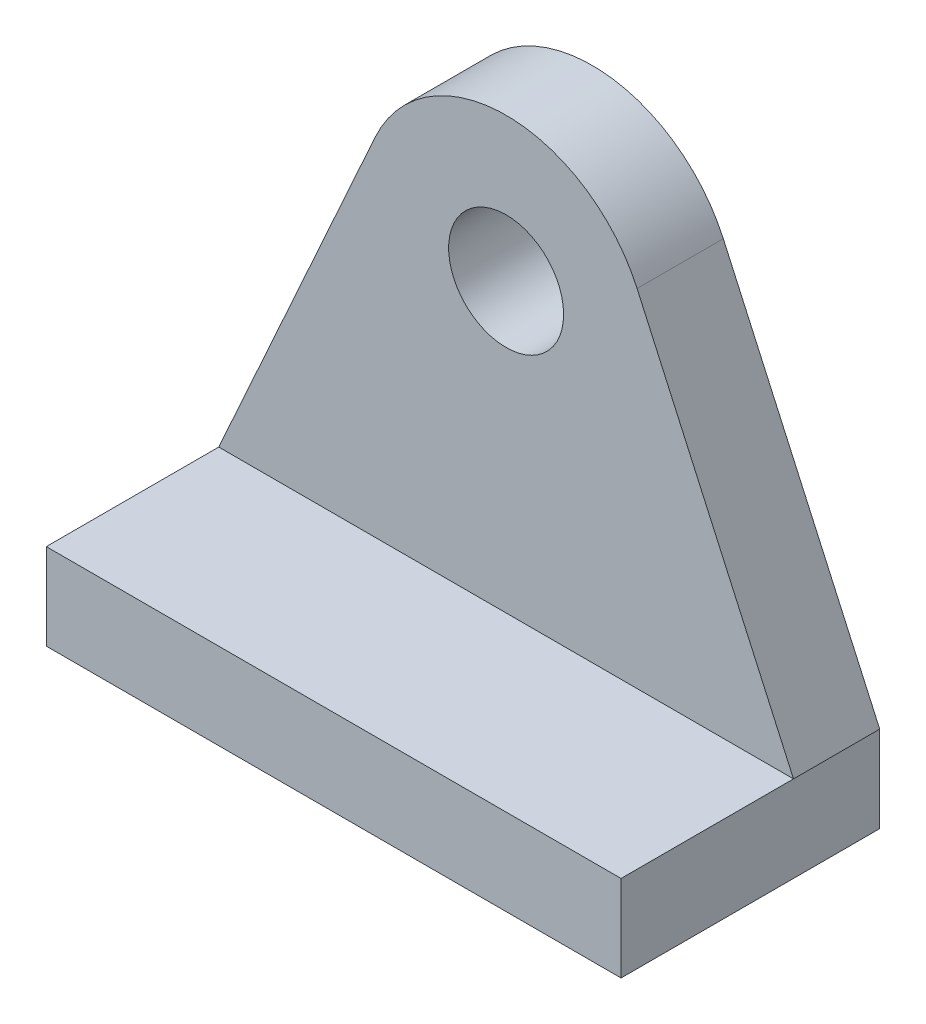
ISO-10303-21;
HEADER;
FILE_DESCRIPTION(('STEP AP214'),'2;1');
FILE_NAME('part.step','',(''),(''),'','','');
FILE_SCHEMA(('AUTOMOTIVE_DESIGN { 1 0 10303 214 1 1 1 1 }'));
ENDSEC;
DATA;
#1=APPLICATION_CONTEXT('core data for automotive mechanical design processes');
#2=APPLICATION_PROTOCOL_DEFINITION('international standard','automotive_design',2000,#1);
#3=PRODUCT_CONTEXT('',#1,'mechanical');
#4=PRODUCT('Part','Part','',(#3));
#5=PRODUCT_RELATED_PRODUCT_CATEGORY('part','',(#4));
#6=PRODUCT_DEFINITION_FORMATION('','',#4);
#7=PRODUCT_DEFINITION_CONTEXT('part definition',#1,'design');
#8=PRODUCT_DEFINITION('design','',#6,#7);
#9=PRODUCT_DEFINITION_SHAPE('','',#8);
#10=(LENGTH_UNIT() NAMED_UNIT(*) SI_UNIT(.MILLI.,.METRE.));
#11=(NAMED_UNIT(*) PLANE_ANGLE_UNIT() SI_UNIT($,.RADIAN.));
#12=(NAMED_UNIT(*) SI_UNIT($,.STERADIAN.) SOLID_ANGLE_UNIT());
#13=UNCERTAINTY_MEASURE_WITH_UNIT(LENGTH_MEASURE(1.E-05),#10,'distance_accuracy_value','');
#14=(GEOMETRIC_REPRESENTATION_CONTEXT(3) GLOBAL_UNCERTAINTY_ASSIGNED_CONTEXT((#13)) GLOBAL_UNIT_ASSIGNED_CONTEXT((#10,
#11,#12)) REPRESENTATION_CONTEXT('',''));
#15=CARTESIAN_POINT('',(0.,0.,0.));
#16=DIRECTION('',(0.,0.,1.));
#17=DIRECTION('',(1.,0.,0.));
#18=AXIS2_PLACEMENT_3D('',#15,#16,#17);
#19=CARTESIAN_POINT('',(0.,0.,3.));
#20=DIRECTION('',(0.,0.,1.));
#21=DIRECTION('',(1.,0.,0.));
#22=AXIS2_PLACEMENT_3D('',#19,#20,#21);
#23=PLANE('',#22);
#24=DIRECTION('',(-0.411437827766147,-0.911437827766148,0.));
#25=VECTOR('',#24,1.);
#26=CARTESIAN_POINT('',(-9.99999999999999,-10.,3.));
#27=LINE('',#26,#25);
#28=CARTESIAN_POINT('',(-4.55718913883074,2.05718913883074,3.));
#29=VERTEX_POINT('',#28);
#30=CARTESIAN_POINT('',(-9.99999999999999,-10.,3.));
#31=VERTEX_POINT('',#30);
#32=EDGE_CURVE('E101',#29,#31,#27,.T.);
#33=ORIENTED_EDGE('',*,*,#32,.T.);
#34=DIRECTION('',(1.,0.,0.));
#35=VECTOR('',#34,1.);
#36=CARTESIAN_POINT('',(0.,-10.,3.));
#37=LINE('',#36,#35);
#38=CARTESIAN_POINT('',(10.,-10.,3.));
#39=VERTEX_POINT('',#38);
#40=EDGE_CURVE('E70',#31,#39,#37,.T.);
#41=ORIENTED_EDGE('',*,*,#40,.T.);
#42=DIRECTION('',(-0.411437827766148,0.911437827766148,0.));
#43=VECTOR('',#42,1.);
#44=CARTESIAN_POINT('',(10.,-10.,3.));
#45=LINE('',#44,#43);
#46=CARTESIAN_POINT('',(4.55718913883074,2.05718913883074,3.));
#47=VERTEX_POINT('',#46);
#48=EDGE_CURVE('E99',#39,#47,#45,.T.);
#49=ORIENTED_EDGE('',*,*,#48,.T.);
#50=CARTESIAN_POINT('',(0.,0.,3.));
#51=DIRECTION('',(0.,0.,1.));
#52=DIRECTION('',(1.,0.,0.));
#53=AXIS2_PLACEMENT_3D('',#50,#51,#52);
#54=CIRCLE('',#53,5.);
#55=EDGE_CURVE('E48',#47,#29,#54,.T.);
#56=ORIENTED_EDGE('',*,*,#55,.T.);
#57=EDGE_LOOP('',(#33,#41,#49,#56));
#58=FACE_BOUND('',#57,.T.);
#59=CARTESIAN_POINT('',(0.,0.,3.));
#60=DIRECTION('',(0.,0.,1.));
#61=DIRECTION('',(1.,0.,0.));
#62=AXIS2_PLACEMENT_3D('',#59,#60,#61);
#63=CIRCLE('',#62,2.);
#64=CARTESIAN_POINT('',(2.,0.,3.));
#65=VERTEX_POINT('',#64);
#66=EDGE_CURVE('E130',#65,#65,#63,.T.);
#67=ORIENTED_EDGE('',*,*,#66,.F.);
#68=EDGE_LOOP('',(#67));
#69=FACE_BOUND('',#68,.T.);
#70=ADVANCED_FACE('F30',(#58,#69),#23,.T.);
#71=CARTESIAN_POINT('',(0.,0.,0.));
#72=DIRECTION('',(0.,0.,1.));
#73=DIRECTION('',(1.,0.,0.));
#74=AXIS2_PLACEMENT_3D('',#71,#72,#73);
#75=PLANE('',#74);
#76=DIRECTION('',(-0.411437827766147,-0.911437827766148,0.));
#77=VECTOR('',#76,1.);
#78=CARTESIAN_POINT('',(-9.99999999999999,-10.,0.));
#79=LINE('',#78,#77);
#80=CARTESIAN_POINT('',(-4.55718913883074,2.05718913883074,0.));
#81=VERTEX_POINT('',#80);
#82=CARTESIAN_POINT('',(-9.99999999999999,-10.,0.));
#83=VERTEX_POINT('',#82);
#84=EDGE_CURVE('E120',#81,#83,#79,.T.);
#85=ORIENTED_EDGE('',*,*,#84,.F.);
#86=CARTESIAN_POINT('',(0.,0.,0.));
#87=DIRECTION('',(0.,0.,1.));
#88=DIRECTION('',(1.,0.,0.));
#89=AXIS2_PLACEMENT_3D('',#86,#87,#88);
#90=CIRCLE('',#89,5.);
#91=CARTESIAN_POINT('',(4.55718913883074,2.05718913883074,0.));
#92=VERTEX_POINT('',#91);
#93=EDGE_CURVE('E114',#92,#81,#90,.T.);
#94=ORIENTED_EDGE('',*,*,#93,.F.);
#95=DIRECTION('',(-0.411437827766148,0.911437827766148,0.));
#96=VECTOR('',#95,1.);
#97=CARTESIAN_POINT('',(10.,-10.,0.));
#98=LINE('',#97,#96);
#99=CARTESIAN_POINT('',(10.,-10.,0.));
#100=VERTEX_POINT('',#99);
#101=EDGE_CURVE('E60',#100,#92,#98,.T.);
#102=ORIENTED_EDGE('',*,*,#101,.F.);
#103=DIRECTION('',(0.,-1.,0.));
#104=VECTOR('',#103,1.);
#105=CARTESIAN_POINT('',(10.,-10.,0.));
#106=LINE('',#105,#104);
#107=CARTESIAN_POINT('',(10.,-13.,0.));
#108=VERTEX_POINT('',#107);
#109=EDGE_CURVE('E94',#100,#108,#106,.T.);
#110=ORIENTED_EDGE('',*,*,#109,.T.);
#111=DIRECTION('',(-1.,0.,0.));
#112=VECTOR('',#111,1.);
#113=CARTESIAN_POINT('',(10.,-13.,0.));
#114=LINE('',#113,#112);
#115=CARTESIAN_POINT('',(-9.99999999999999,-13.,0.));
#116=VERTEX_POINT('',#115);
#117=EDGE_CURVE('E161',#108,#116,#114,.T.);
#118=ORIENTED_EDGE('',*,*,#117,.T.);
#119=DIRECTION('',(0.,1.,0.));
#120=VECTOR('',#119,1.);
#121=CARTESIAN_POINT('',(-9.99999999999999,-10.,0.));
#122=LINE('',#121,#120);
#123=EDGE_CURVE('E144',#116,#83,#122,.T.);
#124=ORIENTED_EDGE('',*,*,#123,.T.);
#125=EDGE_LOOP('',(#85,#94,#102,#110,#118,#124));
#126=FACE_BOUND('',#125,.T.);
#127=CARTESIAN_POINT('',(0.,0.,0.));
#128=DIRECTION('',(0.,0.,1.));
#129=DIRECTION('',(1.,0.,0.));
#130=AXIS2_PLACEMENT_3D('',#127,#128,#129);
#131=CIRCLE('',#130,2.);
#132=CARTESIAN_POINT('',(2.,0.,0.));
#133=VERTEX_POINT('',#132);
#134=EDGE_CURVE('E87',#133,#133,#131,.T.);
#135=ORIENTED_EDGE('',*,*,#134,.T.);
#136=EDGE_LOOP('',(#135));
#137=FACE_BOUND('',#136,.T.);
#138=ADVANCED_FACE('F186',(#126,#137),#75,.F.);
#139=CARTESIAN_POINT('',(-9.99999999999999,-10.,3.));
#140=DIRECTION('',(0.911437827766148,-0.411437827766147,0.));
#141=DIRECTION('',(0.411437827766148,0.911437827766148,0.));
#142=AXIS2_PLACEMENT_3D('',#139,#140,#141);
#143=PLANE('',#142);
#144=ORIENTED_EDGE('',*,*,#84,.T.);
#145=DIRECTION('',(0.,0.,-1.));
#146=VECTOR('',#145,1.);
#147=CARTESIAN_POINT('',(-9.99999999999999,-10.,3.));
#148=LINE('',#147,#146);
#149=EDGE_CURVE('E11',#31,#83,#148,.T.);
#150=ORIENTED_EDGE('',*,*,#149,.F.);
#151=ORIENTED_EDGE('',*,*,#32,.F.);
#152=DIRECTION('',(0.,0.,-1.));
#153=VECTOR('',#152,1.);
#154=CARTESIAN_POINT('',(-4.55718913883074,2.05718913883074,3.));
#155=LINE('',#154,#153);
#156=EDGE_CURVE('E106',#29,#81,#155,.T.);
#157=ORIENTED_EDGE('',*,*,#156,.T.);
#158=EDGE_LOOP('',(#144,#150,#151,#157));
#159=FACE_BOUND('',#158,.T.);
#160=ADVANCED_FACE('F32',(#159),#143,.F.);
#161=CARTESIAN_POINT('',(10.,-10.,3.));
#162=DIRECTION('',(-0.911437827766147,-0.411437827766148,0.));
#163=DIRECTION('',(0.411437827766148,-0.911437827766148,0.));
#164=AXIS2_PLACEMENT_3D('',#161,#162,#163);
#165=PLANE('',#164);
#166=ORIENTED_EDGE('',*,*,#101,.T.);
#167=DIRECTION('',(0.,0.,-1.));
#168=VECTOR('',#167,1.);
#169=CARTESIAN_POINT('',(4.55718913883074,2.05718913883074,3.));
#170=LINE('',#169,#168);
#171=EDGE_CURVE('E96',#47,#92,#170,.T.);
#172=ORIENTED_EDGE('',*,*,#171,.F.);
#173=ORIENTED_EDGE('',*,*,#48,.F.);
#174=DIRECTION('',(0.,0.,-1.));
#175=VECTOR('',#174,1.);
#176=CARTESIAN_POINT('',(10.,-10.,3.));
#177=LINE('',#176,#175);
#178=EDGE_CURVE('E40',#39,#100,#177,.T.);
#179=ORIENTED_EDGE('',*,*,#178,.T.);
#180=EDGE_LOOP('',(#166,#172,#173,#179));
#181=FACE_BOUND('',#180,.T.);
#182=ADVANCED_FACE('F104',(#181),#165,.F.);
#183=CARTESIAN_POINT('',(0.,0.,3.));
#184=DIRECTION('',(0.,0.,-1.));
#185=DIRECTION('',(-1.,0.,0.));
#186=AXIS2_PLACEMENT_3D('',#183,#184,#185);
#187=CYLINDRICAL_SURFACE('',#186,5.);
#188=ORIENTED_EDGE('',*,*,#93,.T.);
#189=ORIENTED_EDGE('',*,*,#156,.F.);
#190=ORIENTED_EDGE('',*,*,#55,.F.);
#191=ORIENTED_EDGE('',*,*,#171,.T.);
#192=EDGE_LOOP('',(#188,#189,#190,#191));
#193=FACE_BOUND('',#192,.T.);
#194=ADVANCED_FACE('F194',(#193),#187,.T.);
#195=CARTESIAN_POINT('',(0.,0.,3.));
#196=DIRECTION('',(0.,0.,-1.));
#197=DIRECTION('',(-1.,0.,0.));
#198=AXIS2_PLACEMENT_3D('',#195,#196,#197);
#199=CYLINDRICAL_SURFACE('',#198,2.);
#200=ORIENTED_EDGE('',*,*,#66,.T.);
#201=EDGE_LOOP('',(#200));
#202=FACE_BOUND('',#201,.T.);
#203=ORIENTED_EDGE('',*,*,#134,.F.);
#204=EDGE_LOOP('',(#203));
#205=FACE_BOUND('',#204,.T.);
#206=ADVANCED_FACE('F192',(#202,#205),#199,.F.);
#207=CARTESIAN_POINT('',(10.,-10.,9.));
#208=DIRECTION('',(0.,1.,0.));
#209=DIRECTION('',(0.,0.,1.));
#210=AXIS2_PLACEMENT_3D('',#207,#208,#209);
#211=PLANE('',#210);
#212=ORIENTED_EDGE('',*,*,#40,.F.);
#213=DIRECTION('',(0.,0.,-1.));
#214=VECTOR('',#213,1.);
#215=CARTESIAN_POINT('',(-9.99999999999999,-10.,9.));
#216=LINE('',#215,#214);
#217=CARTESIAN_POINT('',(-9.99999999999999,-10.,9.));
#218=VERTEX_POINT('',#217);
#219=EDGE_CURVE('E88',#218,#31,#216,.T.);
#220=ORIENTED_EDGE('',*,*,#219,.F.);
#221=DIRECTION('',(1.,0.,0.));
#222=VECTOR('',#221,1.);
#223=CARTESIAN_POINT('',(10.,-10.,9.));
#224=LINE('',#223,#222);
#225=CARTESIAN_POINT('',(10.,-10.,9.));
#226=VERTEX_POINT('',#225);
#227=EDGE_CURVE('E83',#218,#226,#224,.T.);
#228=ORIENTED_EDGE('',*,*,#227,.T.);
#229=DIRECTION('',(0.,0.,-1.));
#230=VECTOR('',#229,1.);
#231=CARTESIAN_POINT('',(10.,-10.,9.));
#232=LINE('',#231,#230);
#233=EDGE_CURVE('E79',#226,#39,#232,.T.);
#234=ORIENTED_EDGE('',*,*,#233,.T.);
#235=EDGE_LOOP('',(#212,#220,#228,#234));
#236=FACE_BOUND('',#235,.T.);
#237=ADVANCED_FACE('F81',(#236),#211,.T.);
#238=CARTESIAN_POINT('',(10.,-10.,9.));
#239=DIRECTION('',(1.,0.,0.));
#240=DIRECTION('',(0.,0.,-1.));
#241=AXIS2_PLACEMENT_3D('',#238,#239,#240);
#242=PLANE('',#241);
#243=ORIENTED_EDGE('',*,*,#109,.F.);
#244=ORIENTED_EDGE('',*,*,#178,.F.);
#245=ORIENTED_EDGE('',*,*,#233,.F.);
#246=DIRECTION('',(0.,-1.,0.));
#247=VECTOR('',#246,1.);
#248=CARTESIAN_POINT('',(10.,-10.,9.));
#249=LINE('',#248,#247);
#250=CARTESIAN_POINT('',(10.,-13.,9.));
#251=VERTEX_POINT('',#250);
#252=EDGE_CURVE('E166',#226,#251,#249,.T.);
#253=ORIENTED_EDGE('',*,*,#252,.T.);
#254=DIRECTION('',(0.,0.,-1.));
#255=VECTOR('',#254,1.);
#256=CARTESIAN_POINT('',(10.,-13.,9.));
#257=LINE('',#256,#255);
#258=EDGE_CURVE('E150',#251,#108,#257,.T.);
#259=ORIENTED_EDGE('',*,*,#258,.T.);
#260=EDGE_LOOP('',(#243,#244,#245,#253,#259));
#261=FACE_BOUND('',#260,.T.);
#262=ADVANCED_FACE('F91',(#261),#242,.T.);
#263=CARTESIAN_POINT('',(-9.99999999999999,-10.,9.));
#264=DIRECTION('',(-1.,0.,0.));
#265=DIRECTION('',(0.,0.,1.));
#266=AXIS2_PLACEMENT_3D('',#263,#264,#265);
#267=PLANE('',#266);
#268=ORIENTED_EDGE('',*,*,#123,.F.);
#269=DIRECTION('',(0.,0.,-1.));
#270=VECTOR('',#269,1.);
#271=CARTESIAN_POINT('',(-9.99999999999999,-13.,9.));
#272=LINE('',#271,#270);
#273=CARTESIAN_POINT('',(-9.99999999999999,-13.,9.));
#274=VERTEX_POINT('',#273);
#275=EDGE_CURVE('E148',#274,#116,#272,.T.);
#276=ORIENTED_EDGE('',*,*,#275,.F.);
#277=DIRECTION('',(0.,1.,0.));
#278=VECTOR('',#277,1.);
#279=CARTESIAN_POINT('',(-9.99999999999999,-10.,9.));
#280=LINE('',#279,#278);
#281=EDGE_CURVE('E154',#274,#218,#280,.T.);
#282=ORIENTED_EDGE('',*,*,#281,.T.);
#283=ORIENTED_EDGE('',*,*,#219,.T.);
#284=ORIENTED_EDGE('',*,*,#149,.T.);
#285=EDGE_LOOP('',(#268,#276,#282,#283,#284));
#286=FACE_BOUND('',#285,.T.);
#287=ADVANCED_FACE('F185',(#286),#267,.T.);
#288=CARTESIAN_POINT('',(10.,-13.,9.));
#289=DIRECTION('',(0.,-1.,0.));
#290=DIRECTION('',(0.,0.,-1.));
#291=AXIS2_PLACEMENT_3D('',#288,#289,#290);
#292=PLANE('',#291);
#293=ORIENTED_EDGE('',*,*,#117,.F.);
#294=ORIENTED_EDGE('',*,*,#258,.F.);
#295=DIRECTION('',(-1.,0.,0.));
#296=VECTOR('',#295,1.);
#297=CARTESIAN_POINT('',(10.,-13.,9.));
#298=LINE('',#297,#296);
#299=EDGE_CURVE('E157',#251,#274,#298,.T.);
#300=ORIENTED_EDGE('',*,*,#299,.T.);
#301=ORIENTED_EDGE('',*,*,#275,.T.);
#302=EDGE_LOOP('',(#293,#294,#300,#301));
#303=FACE_BOUND('',#302,.T.);
#304=ADVANCED_FACE('F174',(#303),#292,.T.);
#305=CARTESIAN_POINT('',(10.,-13.,9.));
#306=DIRECTION('',(0.,0.,-1.));
#307=DIRECTION('',(-1.,0.,0.));
#308=AXIS2_PLACEMENT_3D('',#305,#306,#307);
#309=PLANE('',#308);
#310=ORIENTED_EDGE('',*,*,#252,.F.);
#311=ORIENTED_EDGE('',*,*,#227,.F.);
#312=ORIENTED_EDGE('',*,*,#281,.F.);
#313=ORIENTED_EDGE('',*,*,#299,.F.);
#314=EDGE_LOOP('',(#310,#311,#312,#313));
#315=FACE_BOUND('',#314,.T.);
#316=ADVANCED_FACE('F179',(#315),#309,.F.);
#317=CLOSED_SHELL('',(#70,#138,#160,#182,#194,#206,#237,#262,#287,#304,#316));
#318=MANIFOLD_SOLID_BREP('B2',#317);
#319=ADVANCED_BREP_SHAPE_REPRESENTATION('',(#18,#318),#14);
#320=SHAPE_DEFINITION_REPRESENTATION(#9,#319);
ENDSEC;
END-ISO-10303-21;
